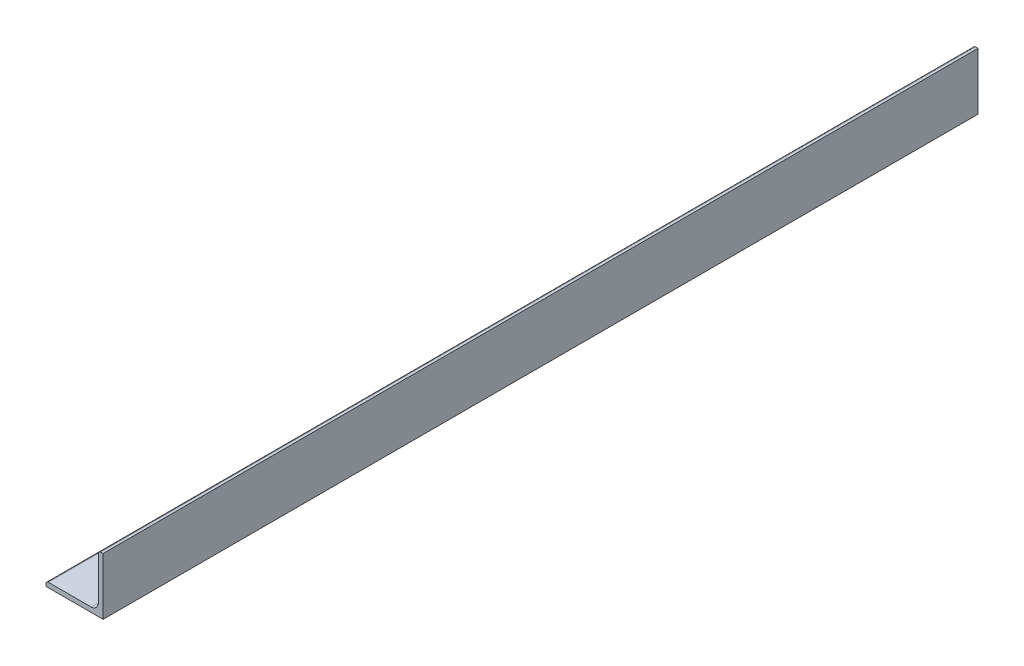
ISO-10303-21;
HEADER;
FILE_DESCRIPTION(('STEP AP214'),'2;1');
FILE_NAME('part.step','',(''),(''),'','','');
FILE_SCHEMA(('AUTOMOTIVE_DESIGN { 1 0 10303 214 1 1 1 1 }'));
ENDSEC;
DATA;
#1=APPLICATION_CONTEXT('core data for automotive mechanical design processes');
#2=APPLICATION_PROTOCOL_DEFINITION('international standard','automotive_design',2000,#1);
#3=PRODUCT_CONTEXT('',#1,'mechanical');
#4=PRODUCT('Part','Part','',(#3));
#5=PRODUCT_RELATED_PRODUCT_CATEGORY('part','',(#4));
#6=PRODUCT_DEFINITION_FORMATION('','',#4);
#7=PRODUCT_DEFINITION_CONTEXT('part definition',#1,'design');
#8=PRODUCT_DEFINITION('design','',#6,#7);
#9=PRODUCT_DEFINITION_SHAPE('','',#8);
#10=(LENGTH_UNIT() NAMED_UNIT(*) SI_UNIT(.MILLI.,.METRE.));
#11=(NAMED_UNIT(*) PLANE_ANGLE_UNIT() SI_UNIT($,.RADIAN.));
#12=(NAMED_UNIT(*) SI_UNIT($,.STERADIAN.) SOLID_ANGLE_UNIT());
#13=UNCERTAINTY_MEASURE_WITH_UNIT(LENGTH_MEASURE(1.E-05),#10,'distance_accuracy_value','');
#14=(GEOMETRIC_REPRESENTATION_CONTEXT(3) GLOBAL_UNCERTAINTY_ASSIGNED_CONTEXT((#13)) GLOBAL_UNIT_ASSIGNED_CONTEXT((#10,
#11,#12)) REPRESENTATION_CONTEXT('',''));
#15=CARTESIAN_POINT('',(0.,0.,0.));
#16=DIRECTION('',(0.,0.,1.));
#17=DIRECTION('',(1.,0.,0.));
#18=AXIS2_PLACEMENT_3D('',#15,#16,#17);
#19=CARTESIAN_POINT('',(-19.05,-17.4625,609.6));
#20=DIRECTION('',(1.,0.,0.));
#21=DIRECTION('',(0.,0.,-1.));
#22=AXIS2_PLACEMENT_3D('',#19,#20,#21);
#23=PLANE('',#22);
#24=DIRECTION('',(0.,0.,-1.));
#25=VECTOR('',#24,1.);
#26=CARTESIAN_POINT('',(-19.05,-17.4625,609.6));
#27=LINE('',#26,#25);
#28=CARTESIAN_POINT('',(-19.05,-17.4625,609.6));
#29=VERTEX_POINT('',#28);
#30=CARTESIAN_POINT('',(-19.05,-17.4625,25.6000000000004));
#31=VERTEX_POINT('',#30);
#32=EDGE_CURVE('E152',#29,#31,#27,.T.);
#33=ORIENTED_EDGE('',*,*,#32,.T.);
#34=DIRECTION('',(0.,-1.,0.));
#35=VECTOR('',#34,1.);
#36=CARTESIAN_POINT('',(-19.05,-17.4625,25.6000000000002));
#37=LINE('',#36,#35);
#38=CARTESIAN_POINT('',(-19.05,-19.05,25.6000000000001));
#39=VERTEX_POINT('',#38);
#40=EDGE_CURVE('E57',#31,#39,#37,.T.);
#41=ORIENTED_EDGE('',*,*,#40,.T.);
#42=DIRECTION('',(0.,0.,-1.));
#43=VECTOR('',#42,1.);
#44=CARTESIAN_POINT('',(-19.05,-19.05,609.6));
#45=LINE('',#44,#43);
#46=CARTESIAN_POINT('',(-19.05,-19.05,609.6));
#47=VERTEX_POINT('',#46);
#48=EDGE_CURVE('E50',#47,#39,#45,.T.);
#49=ORIENTED_EDGE('',*,*,#48,.F.);
#50=DIRECTION('',(0.,-1.,0.));
#51=VECTOR('',#50,1.);
#52=CARTESIAN_POINT('',(-19.05,-17.4625,609.6));
#53=LINE('',#52,#51);
#54=EDGE_CURVE('E169',#29,#47,#53,.T.);
#55=ORIENTED_EDGE('',*,*,#54,.F.);
#56=EDGE_LOOP('',(#33,#41,#49,#55));
#57=FACE_BOUND('',#56,.T.);
#58=ADVANCED_FACE('F43',(#57),#23,.F.);
#59=CARTESIAN_POINT('',(-19.05,-19.05,609.6));
#60=DIRECTION('',(0.,1.,0.));
#61=DIRECTION('',(-1.,0.,0.));
#62=AXIS2_PLACEMENT_3D('',#59,#60,#61);
#63=PLANE('',#62);
#64=ORIENTED_EDGE('',*,*,#48,.T.);
#65=DIRECTION('',(1.,0.,0.));
#66=VECTOR('',#65,1.);
#67=CARTESIAN_POINT('',(-40.95,-19.05,25.6000000000001));
#68=LINE('',#67,#66);
#69=CARTESIAN_POINT('',(19.05,-19.05,25.6000000000001));
#70=VERTEX_POINT('',#69);
#71=EDGE_CURVE('E114',#39,#70,#68,.T.);
#72=ORIENTED_EDGE('',*,*,#71,.T.);
#73=DIRECTION('',(0.,0.,-1.));
#74=VECTOR('',#73,1.);
#75=CARTESIAN_POINT('',(19.05,-19.05,609.6));
#76=LINE('',#75,#74);
#77=CARTESIAN_POINT('',(19.05,-19.05,609.6));
#78=VERTEX_POINT('',#77);
#79=EDGE_CURVE('E126',#78,#70,#76,.T.);
#80=ORIENTED_EDGE('',*,*,#79,.F.);
#81=DIRECTION('',(1.,0.,0.));
#82=VECTOR('',#81,1.);
#83=CARTESIAN_POINT('',(-19.05,-19.05,609.6));
#84=LINE('',#83,#82);
#85=EDGE_CURVE('E167',#47,#78,#84,.T.);
#86=ORIENTED_EDGE('',*,*,#85,.F.);
#87=EDGE_LOOP('',(#64,#72,#80,#86));
#88=FACE_BOUND('',#87,.T.);
#89=ADVANCED_FACE('F125',(#88),#63,.F.);
#90=CARTESIAN_POINT('',(19.05,-19.05,609.6));
#91=DIRECTION('',(-1.,0.,0.));
#92=DIRECTION('',(0.,-1.,0.));
#93=AXIS2_PLACEMENT_3D('',#90,#91,#92);
#94=PLANE('',#93);
#95=ORIENTED_EDGE('',*,*,#79,.T.);
#96=DIRECTION('',(0.,-1.,0.));
#97=VECTOR('',#96,1.);
#98=CARTESIAN_POINT('',(19.05,19.0499999999999,25.6000000000001));
#99=LINE('',#98,#97);
#100=CARTESIAN_POINT('',(19.05,19.0499999999999,25.6000000000001));
#101=VERTEX_POINT('',#100);
#102=EDGE_CURVE('E111',#101,#70,#99,.T.);
#103=ORIENTED_EDGE('',*,*,#102,.F.);
#104=DIRECTION('',(0.,0.,-1.));
#105=VECTOR('',#104,1.);
#106=CARTESIAN_POINT('',(19.05,19.05,609.6));
#107=LINE('',#106,#105);
#108=CARTESIAN_POINT('',(19.05,19.05,609.6));
#109=VERTEX_POINT('',#108);
#110=EDGE_CURVE('E133',#109,#101,#107,.T.);
#111=ORIENTED_EDGE('',*,*,#110,.F.);
#112=DIRECTION('',(0.,1.,0.));
#113=VECTOR('',#112,1.);
#114=CARTESIAN_POINT('',(19.05,-19.05,609.6));
#115=LINE('',#114,#113);
#116=EDGE_CURVE('E132',#78,#109,#115,.T.);
#117=ORIENTED_EDGE('',*,*,#116,.F.);
#118=EDGE_LOOP('',(#95,#103,#111,#117));
#119=FACE_BOUND('',#118,.T.);
#120=ADVANCED_FACE('F131',(#119),#94,.F.);
#121=CARTESIAN_POINT('',(17.4625,19.05,609.6));
#122=DIRECTION('',(0.,-1.,0.));
#123=DIRECTION('',(1.,0.,0.));
#124=AXIS2_PLACEMENT_3D('',#121,#122,#123);
#125=PLANE('',#124);
#126=ORIENTED_EDGE('',*,*,#110,.T.);
#127=DIRECTION('',(1.,0.,0.));
#128=VECTOR('',#127,1.);
#129=CARTESIAN_POINT('',(-40.95,19.0499999999999,25.6000000000001));
#130=LINE('',#129,#128);
#131=CARTESIAN_POINT('',(17.4625,19.0499999999999,25.6000000000001));
#132=VERTEX_POINT('',#131);
#133=EDGE_CURVE('E116',#132,#101,#130,.T.);
#134=ORIENTED_EDGE('',*,*,#133,.F.);
#135=DIRECTION('',(0.,0.,-1.));
#136=VECTOR('',#135,1.);
#137=CARTESIAN_POINT('',(17.4625,19.05,609.6));
#138=LINE('',#137,#136);
#139=CARTESIAN_POINT('',(17.4625,19.05,609.6));
#140=VERTEX_POINT('',#139);
#141=EDGE_CURVE('E135',#140,#132,#138,.T.);
#142=ORIENTED_EDGE('',*,*,#141,.F.);
#143=DIRECTION('',(-1.,0.,0.));
#144=VECTOR('',#143,1.);
#145=CARTESIAN_POINT('',(17.4625,19.05,609.6));
#146=LINE('',#145,#144);
#147=EDGE_CURVE('E164',#109,#140,#146,.T.);
#148=ORIENTED_EDGE('',*,*,#147,.F.);
#149=EDGE_LOOP('',(#126,#134,#142,#148));
#150=FACE_BOUND('',#149,.T.);
#151=ADVANCED_FACE('F196',(#150),#125,.F.);
#152=CARTESIAN_POINT('',(17.4625,17.4625,609.6));
#153=DIRECTION('',(0.,0.,-1.));
#154=DIRECTION('',(-1.,0.,0.));
#155=AXIS2_PLACEMENT_3D('',#152,#153,#154);
#156=CYLINDRICAL_SURFACE('',#155,1.5875);
#157=ORIENTED_EDGE('',*,*,#141,.T.);
#158=CARTESIAN_POINT('',(17.4625,17.4625,25.6000000000002));
#159=DIRECTION('',(0.,0.,1.));
#160=DIRECTION('',(1.,0.,0.));
#161=AXIS2_PLACEMENT_3D('',#158,#159,#160);
#162=CIRCLE('',#161,1.5875);
#163=CARTESIAN_POINT('',(15.875,17.4625,25.6000000000001));
#164=VERTEX_POINT('',#163);
#165=EDGE_CURVE('E172',#132,#164,#162,.T.);
#166=ORIENTED_EDGE('',*,*,#165,.T.);
#167=DIRECTION('',(0.,0.,-1.));
#168=VECTOR('',#167,1.);
#169=CARTESIAN_POINT('',(15.875,17.4625,609.6));
#170=LINE('',#169,#168);
#171=CARTESIAN_POINT('',(15.875,17.4625,609.6));
#172=VERTEX_POINT('',#171);
#173=EDGE_CURVE('E140',#172,#164,#170,.T.);
#174=ORIENTED_EDGE('',*,*,#173,.F.);
#175=CARTESIAN_POINT('',(17.4625,17.4625,609.6));
#176=DIRECTION('',(0.,0.,1.));
#177=DIRECTION('',(-1.,0.,0.));
#178=AXIS2_PLACEMENT_3D('',#175,#176,#177);
#179=CIRCLE('',#178,1.5875);
#180=EDGE_CURVE('E162',#140,#172,#179,.T.);
#181=ORIENTED_EDGE('',*,*,#180,.F.);
#182=EDGE_LOOP('',(#157,#166,#174,#181));
#183=FACE_BOUND('',#182,.T.);
#184=ADVANCED_FACE('F200',(#183),#156,.T.);
#185=CARTESIAN_POINT('',(15.875,17.4625,609.6));
#186=DIRECTION('',(1.,0.,0.));
#187=DIRECTION('',(0.,1.,0.));
#188=AXIS2_PLACEMENT_3D('',#185,#186,#187);
#189=PLANE('',#188);
#190=ORIENTED_EDGE('',*,*,#173,.T.);
#191=DIRECTION('',(0.,-1.,0.));
#192=VECTOR('',#191,1.);
#193=CARTESIAN_POINT('',(15.875,17.4625,25.6000000000001));
#194=LINE('',#193,#192);
#195=CARTESIAN_POINT('',(15.875,-11.0998,25.6000000000002));
#196=VERTEX_POINT('',#195);
#197=EDGE_CURVE('E175',#164,#196,#194,.T.);
#198=ORIENTED_EDGE('',*,*,#197,.T.);
#199=DIRECTION('',(0.,0.,-1.));
#200=VECTOR('',#199,1.);
#201=CARTESIAN_POINT('',(15.875,-11.0998,609.6));
#202=LINE('',#201,#200);
#203=CARTESIAN_POINT('',(15.875,-11.0998,609.6));
#204=VERTEX_POINT('',#203);
#205=EDGE_CURVE('E143',#204,#196,#202,.T.);
#206=ORIENTED_EDGE('',*,*,#205,.F.);
#207=DIRECTION('',(0.,-1.,0.));
#208=VECTOR('',#207,1.);
#209=CARTESIAN_POINT('',(15.875,17.4625,609.6));
#210=LINE('',#209,#208);
#211=EDGE_CURVE('E160',#172,#204,#210,.T.);
#212=ORIENTED_EDGE('',*,*,#211,.F.);
#213=EDGE_LOOP('',(#190,#198,#206,#212));
#214=FACE_BOUND('',#213,.T.);
#215=ADVANCED_FACE('F205',(#214),#189,.F.);
#216=CARTESIAN_POINT('',(11.0998,-11.0998,609.6));
#217=DIRECTION('',(0.,0.,-1.));
#218=DIRECTION('',(-1.,0.,0.));
#219=AXIS2_PLACEMENT_3D('',#216,#217,#218);
#220=CYLINDRICAL_SURFACE('',#219,4.7752);
#221=ORIENTED_EDGE('',*,*,#205,.T.);
#222=CARTESIAN_POINT('',(11.0998,-11.0998,25.6000000000002));
#223=DIRECTION('',(0.,0.,1.));
#224=DIRECTION('',(1.,0.,0.));
#225=AXIS2_PLACEMENT_3D('',#222,#223,#224);
#226=CIRCLE('',#225,4.7752);
#227=CARTESIAN_POINT('',(11.0998,-15.875,25.6000000000002));
#228=VERTEX_POINT('',#227);
#229=EDGE_CURVE('E178',#196,#228,#226,.F.);
#230=ORIENTED_EDGE('',*,*,#229,.T.);
#231=DIRECTION('',(0.,0.,-1.));
#232=VECTOR('',#231,1.);
#233=CARTESIAN_POINT('',(11.0998,-15.875,609.6));
#234=LINE('',#233,#232);
#235=CARTESIAN_POINT('',(11.0998,-15.875,609.6));
#236=VERTEX_POINT('',#235);
#237=EDGE_CURVE('E146',#236,#228,#234,.T.);
#238=ORIENTED_EDGE('',*,*,#237,.F.);
#239=CARTESIAN_POINT('',(11.0998,-11.0998,609.6));
#240=DIRECTION('',(0.,0.,-1.));
#241=DIRECTION('',(-1.,0.,0.));
#242=AXIS2_PLACEMENT_3D('',#239,#240,#241);
#243=CIRCLE('',#242,4.7752);
#244=EDGE_CURVE('E158',#204,#236,#243,.T.);
#245=ORIENTED_EDGE('',*,*,#244,.F.);
#246=EDGE_LOOP('',(#221,#230,#238,#245));
#247=FACE_BOUND('',#246,.T.);
#248=ADVANCED_FACE('F207',(#247),#220,.F.);
#249=CARTESIAN_POINT('',(11.0998,-15.875,609.6));
#250=DIRECTION('',(0.,-1.,0.));
#251=DIRECTION('',(1.,0.,0.));
#252=AXIS2_PLACEMENT_3D('',#249,#250,#251);
#253=PLANE('',#252);
#254=ORIENTED_EDGE('',*,*,#237,.T.);
#255=DIRECTION('',(-1.,0.,0.));
#256=VECTOR('',#255,1.);
#257=CARTESIAN_POINT('',(11.0998,-15.875,25.6000000000002));
#258=LINE('',#257,#256);
#259=CARTESIAN_POINT('',(-17.4625,-15.875,25.6000000000002));
#260=VERTEX_POINT('',#259);
#261=EDGE_CURVE('E129',#228,#260,#258,.T.);
#262=ORIENTED_EDGE('',*,*,#261,.T.);
#263=DIRECTION('',(0.,0.,-1.));
#264=VECTOR('',#263,1.);
#265=CARTESIAN_POINT('',(-17.4625,-15.875,609.6));
#266=LINE('',#265,#264);
#267=CARTESIAN_POINT('',(-17.4625,-15.875,609.6));
#268=VERTEX_POINT('',#267);
#269=EDGE_CURVE('E149',#268,#260,#266,.T.);
#270=ORIENTED_EDGE('',*,*,#269,.F.);
#271=DIRECTION('',(-1.,0.,0.));
#272=VECTOR('',#271,1.);
#273=CARTESIAN_POINT('',(11.0998,-15.875,609.6));
#274=LINE('',#273,#272);
#275=EDGE_CURVE('E156',#236,#268,#274,.T.);
#276=ORIENTED_EDGE('',*,*,#275,.F.);
#277=EDGE_LOOP('',(#254,#262,#270,#276));
#278=FACE_BOUND('',#277,.T.);
#279=ADVANCED_FACE('F185',(#278),#253,.F.);
#280=CARTESIAN_POINT('',(-17.4625,-17.4625,609.6));
#281=DIRECTION('',(0.,0.,-1.));
#282=DIRECTION('',(-1.,0.,0.));
#283=AXIS2_PLACEMENT_3D('',#280,#281,#282);
#284=CYLINDRICAL_SURFACE('',#283,1.5875);
#285=ORIENTED_EDGE('',*,*,#269,.T.);
#286=CARTESIAN_POINT('',(-17.4625,-17.4625,25.6000000000002));
#287=DIRECTION('',(0.,0.,1.));
#288=DIRECTION('',(1.,0.,0.));
#289=AXIS2_PLACEMENT_3D('',#286,#287,#288);
#290=CIRCLE('',#289,1.5875);
#291=EDGE_CURVE('E11',#260,#31,#290,.T.);
#292=ORIENTED_EDGE('',*,*,#291,.T.);
#293=ORIENTED_EDGE('',*,*,#32,.F.);
#294=CARTESIAN_POINT('',(-17.4625,-17.4625,609.6));
#295=DIRECTION('',(0.,0.,1.));
#296=DIRECTION('',(-1.,0.,0.));
#297=AXIS2_PLACEMENT_3D('',#294,#295,#296);
#298=CIRCLE('',#297,1.5875);
#299=EDGE_CURVE('E64',#268,#29,#298,.T.);
#300=ORIENTED_EDGE('',*,*,#299,.F.);
#301=EDGE_LOOP('',(#285,#292,#293,#300));
#302=FACE_BOUND('',#301,.T.);
#303=ADVANCED_FACE('F189',(#302),#284,.T.);
#304=CARTESIAN_POINT('',(17.4625,17.4625,609.6));
#305=DIRECTION('',(0.,0.,-1.));
#306=DIRECTION('',(-1.,0.,0.));
#307=AXIS2_PLACEMENT_3D('',#304,#305,#306);
#308=PLANE('',#307);
#309=ORIENTED_EDGE('',*,*,#54,.T.);
#310=ORIENTED_EDGE('',*,*,#85,.T.);
#311=ORIENTED_EDGE('',*,*,#116,.T.);
#312=ORIENTED_EDGE('',*,*,#147,.T.);
#313=ORIENTED_EDGE('',*,*,#180,.T.);
#314=ORIENTED_EDGE('',*,*,#211,.T.);
#315=ORIENTED_EDGE('',*,*,#244,.T.);
#316=ORIENTED_EDGE('',*,*,#275,.T.);
#317=ORIENTED_EDGE('',*,*,#299,.T.);
#318=EDGE_LOOP('',(#309,#310,#311,#312,#313,#314,#315,#316,#317));
#319=FACE_BOUND('',#318,.T.);
#320=ADVANCED_FACE('F192',(#319),#308,.F.);
#321=CARTESIAN_POINT('',(-40.95,19.0499999999999,25.6000000000001));
#322=DIRECTION('',(0.,0.,1.));
#323=DIRECTION('',(1.,0.,0.));
#324=AXIS2_PLACEMENT_3D('',#321,#322,#323);
#325=PLANE('',#324);
#326=ORIENTED_EDGE('',*,*,#291,.F.);
#327=ORIENTED_EDGE('',*,*,#261,.F.);
#328=ORIENTED_EDGE('',*,*,#229,.F.);
#329=ORIENTED_EDGE('',*,*,#197,.F.);
#330=ORIENTED_EDGE('',*,*,#165,.F.);
#331=ORIENTED_EDGE('',*,*,#133,.T.);
#332=ORIENTED_EDGE('',*,*,#102,.T.);
#333=ORIENTED_EDGE('',*,*,#71,.F.);
#334=ORIENTED_EDGE('',*,*,#40,.F.);
#335=EDGE_LOOP('',(#326,#327,#328,#329,#330,#331,#332,#333,#334));
#336=FACE_BOUND('',#335,.T.);
#337=ADVANCED_FACE('F113',(#336),#325,.F.);
#338=CLOSED_SHELL('',(#58,#89,#120,#151,#184,#215,#248,#279,#303,#320,#337));
#339=MANIFOLD_SOLID_BREP('B2',#338);
#340=ADVANCED_BREP_SHAPE_REPRESENTATION('',(#18,#339),#14);
#341=SHAPE_DEFINITION_REPRESENTATION(#9,#340);
ENDSEC;
END-ISO-10303-21;
